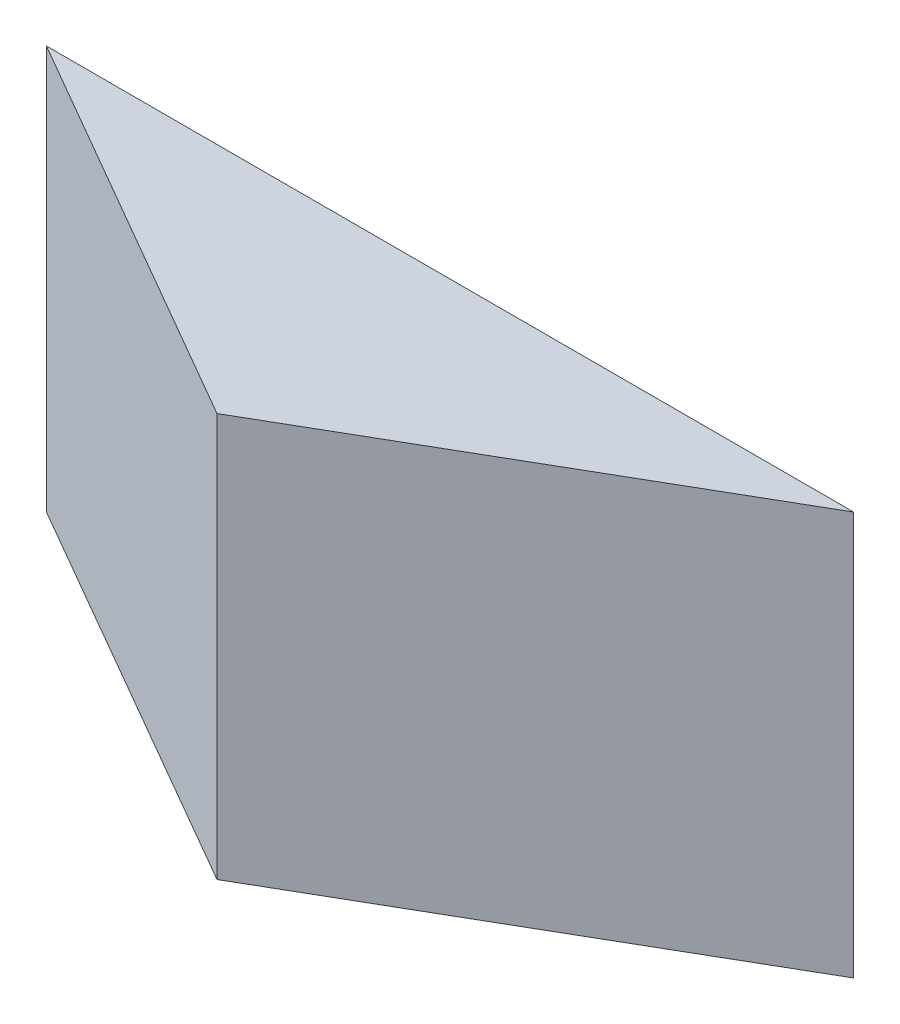
ISO-10303-21;
HEADER;
FILE_DESCRIPTION(('STEP AP214'),'2;1');
FILE_NAME('part.step','',(''),(''),'','','');
FILE_SCHEMA(('AUTOMOTIVE_DESIGN { 1 0 10303 214 1 1 1 1 }'));
ENDSEC;
DATA;
#1=APPLICATION_CONTEXT('core data for automotive mechanical design processes');
#2=APPLICATION_PROTOCOL_DEFINITION('international standard','automotive_design',2000,#1);
#3=PRODUCT_CONTEXT('',#1,'mechanical');
#4=PRODUCT('Part','Part','',(#3));
#5=PRODUCT_RELATED_PRODUCT_CATEGORY('part','',(#4));
#6=PRODUCT_DEFINITION_FORMATION('','',#4);
#7=PRODUCT_DEFINITION_CONTEXT('part definition',#1,'design');
#8=PRODUCT_DEFINITION('design','',#6,#7);
#9=PRODUCT_DEFINITION_SHAPE('','',#8);
#10=(LENGTH_UNIT() NAMED_UNIT(*) SI_UNIT(.MILLI.,.METRE.));
#11=(NAMED_UNIT(*) PLANE_ANGLE_UNIT() SI_UNIT($,.RADIAN.));
#12=(NAMED_UNIT(*) SI_UNIT($,.STERADIAN.) SOLID_ANGLE_UNIT());
#13=UNCERTAINTY_MEASURE_WITH_UNIT(LENGTH_MEASURE(1.E-05),#10,'distance_accuracy_value','');
#14=(GEOMETRIC_REPRESENTATION_CONTEXT(3) GLOBAL_UNCERTAINTY_ASSIGNED_CONTEXT((#13)) GLOBAL_UNIT_ASSIGNED_CONTEXT((#10,
#11,#12)) REPRESENTATION_CONTEXT('',''));
#15=CARTESIAN_POINT('',(0.,0.,0.));
#16=DIRECTION('',(0.,0.,1.));
#17=DIRECTION('',(1.,0.,0.));
#18=AXIS2_PLACEMENT_3D('',#15,#16,#17);
#19=CARTESIAN_POINT('',(0.,12.7,0.));
#20=DIRECTION('',(0.500000000000001,0.,-0.866025403784438));
#21=DIRECTION('',(-0.866025403784438,0.,-0.500000000000001));
#22=AXIS2_PLACEMENT_3D('',#19,#20,#21);
#23=PLANE('',#22);
#24=DIRECTION('',(0.866025403784438,0.,0.500000000000001));
#25=VECTOR('',#24,1.);
#26=CARTESIAN_POINT('',(0.,0.,0.));
#27=LINE('',#26,#25);
#28=CARTESIAN_POINT('',(-12.7,0.,-7.33234841870827));
#29=VERTEX_POINT('',#28);
#30=CARTESIAN_POINT('',(0.,0.,0.));
#31=VERTEX_POINT('',#30);
#32=EDGE_CURVE('E80',#29,#31,#27,.T.);
#33=ORIENTED_EDGE('',*,*,#32,.T.);
#34=DIRECTION('',(0.,-1.,0.));
#35=VECTOR('',#34,1.);
#36=CARTESIAN_POINT('',(0.,12.7,0.));
#37=LINE('',#36,#35);
#38=CARTESIAN_POINT('',(0.,12.7,0.));
#39=VERTEX_POINT('',#38);
#40=EDGE_CURVE('E11',#39,#31,#37,.T.);
#41=ORIENTED_EDGE('',*,*,#40,.F.);
#42=DIRECTION('',(0.866025403784438,0.,0.500000000000001));
#43=VECTOR('',#42,1.);
#44=CARTESIAN_POINT('',(0.,12.7,0.));
#45=LINE('',#44,#43);
#46=CARTESIAN_POINT('',(-12.7,12.7,-7.33234841870827));
#47=VERTEX_POINT('',#46);
#48=EDGE_CURVE('E73',#47,#39,#45,.T.);
#49=ORIENTED_EDGE('',*,*,#48,.F.);
#50=DIRECTION('',(0.,-1.,0.));
#51=VECTOR('',#50,1.);
#52=CARTESIAN_POINT('',(-12.7,12.7,-7.33234841870827));
#53=LINE('',#52,#51);
#54=EDGE_CURVE('E81',#47,#29,#53,.T.);
#55=ORIENTED_EDGE('',*,*,#54,.T.);
#56=EDGE_LOOP('',(#33,#41,#49,#55));
#57=FACE_BOUND('',#56,.T.);
#58=ADVANCED_FACE('F33',(#57),#23,.F.);
#59=CARTESIAN_POINT('',(0.,12.7,0.));
#60=DIRECTION('',(-0.500000000000001,0.,-0.866025403784438));
#61=DIRECTION('',(-0.866025403784438,0.,0.500000000000001));
#62=AXIS2_PLACEMENT_3D('',#59,#60,#61);
#63=PLANE('',#62);
#64=DIRECTION('',(0.866025403784438,0.,-0.500000000000001));
#65=VECTOR('',#64,1.);
#66=CARTESIAN_POINT('',(0.,0.,0.));
#67=LINE('',#66,#65);
#68=CARTESIAN_POINT('',(12.7,0.,-7.33234841870827));
#69=VERTEX_POINT('',#68);
#70=EDGE_CURVE('E61',#31,#69,#67,.T.);
#71=ORIENTED_EDGE('',*,*,#70,.T.);
#72=DIRECTION('',(0.,-1.,0.));
#73=VECTOR('',#72,1.);
#74=CARTESIAN_POINT('',(12.7,12.7,-7.33234841870827));
#75=LINE('',#74,#73);
#76=CARTESIAN_POINT('',(12.7,12.7,-7.33234841870827));
#77=VERTEX_POINT('',#76);
#78=EDGE_CURVE('E41',#77,#69,#75,.T.);
#79=ORIENTED_EDGE('',*,*,#78,.F.);
#80=DIRECTION('',(0.866025403784438,0.,-0.500000000000001));
#81=VECTOR('',#80,1.);
#82=CARTESIAN_POINT('',(0.,12.7,0.));
#83=LINE('',#82,#81);
#84=EDGE_CURVE('E69',#39,#77,#83,.T.);
#85=ORIENTED_EDGE('',*,*,#84,.F.);
#86=ORIENTED_EDGE('',*,*,#40,.T.);
#87=EDGE_LOOP('',(#71,#79,#85,#86));
#88=FACE_BOUND('',#87,.T.);
#89=ADVANCED_FACE('F70',(#88),#63,.F.);
#90=CARTESIAN_POINT('',(12.7,12.7,-7.33234841870827));
#91=DIRECTION('',(0.,0.,1.));
#92=DIRECTION('',(1.,0.,0.));
#93=AXIS2_PLACEMENT_3D('',#90,#91,#92);
#94=PLANE('',#93);
#95=DIRECTION('',(-1.,0.,0.));
#96=VECTOR('',#95,1.);
#97=CARTESIAN_POINT('',(12.7,0.,-7.33234841870827));
#98=LINE('',#97,#96);
#99=EDGE_CURVE('E66',#69,#29,#98,.T.);
#100=ORIENTED_EDGE('',*,*,#99,.T.);
#101=ORIENTED_EDGE('',*,*,#54,.F.);
#102=DIRECTION('',(-1.,0.,0.));
#103=VECTOR('',#102,1.);
#104=CARTESIAN_POINT('',(12.7,12.7,-7.33234841870827));
#105=LINE('',#104,#103);
#106=EDGE_CURVE('E49',#77,#47,#105,.T.);
#107=ORIENTED_EDGE('',*,*,#106,.F.);
#108=ORIENTED_EDGE('',*,*,#78,.T.);
#109=EDGE_LOOP('',(#100,#101,#107,#108));
#110=FACE_BOUND('',#109,.T.);
#111=ADVANCED_FACE('F88',(#110),#94,.F.);
#112=CARTESIAN_POINT('',(0.,12.7,0.));
#113=DIRECTION('',(0.,-1.,0.));
#114=DIRECTION('',(0.,0.,-1.));
#115=AXIS2_PLACEMENT_3D('',#112,#113,#114);
#116=PLANE('',#115);
#117=ORIENTED_EDGE('',*,*,#48,.T.);
#118=ORIENTED_EDGE('',*,*,#84,.T.);
#119=ORIENTED_EDGE('',*,*,#106,.T.);
#120=EDGE_LOOP('',(#117,#118,#119));
#121=FACE_BOUND('',#120,.T.);
#122=ADVANCED_FACE('F76',(#121),#116,.F.);
#123=CARTESIAN_POINT('',(0.,0.,0.));
#124=DIRECTION('',(0.,-1.,0.));
#125=DIRECTION('',(0.,0.,-1.));
#126=AXIS2_PLACEMENT_3D('',#123,#124,#125);
#127=PLANE('',#126);
#128=ORIENTED_EDGE('',*,*,#32,.F.);
#129=ORIENTED_EDGE('',*,*,#99,.F.);
#130=ORIENTED_EDGE('',*,*,#70,.F.);
#131=EDGE_LOOP('',(#128,#129,#130));
#132=FACE_BOUND('',#131,.T.);
#133=ADVANCED_FACE('F89',(#132),#127,.T.);
#134=CLOSED_SHELL('',(#58,#89,#111,#122,#133));
#135=MANIFOLD_SOLID_BREP('B2',#134);
#136=ADVANCED_BREP_SHAPE_REPRESENTATION('',(#18,#135),#14);
#137=SHAPE_DEFINITION_REPRESENTATION(#9,#136);
ENDSEC;
END-ISO-10303-21;
